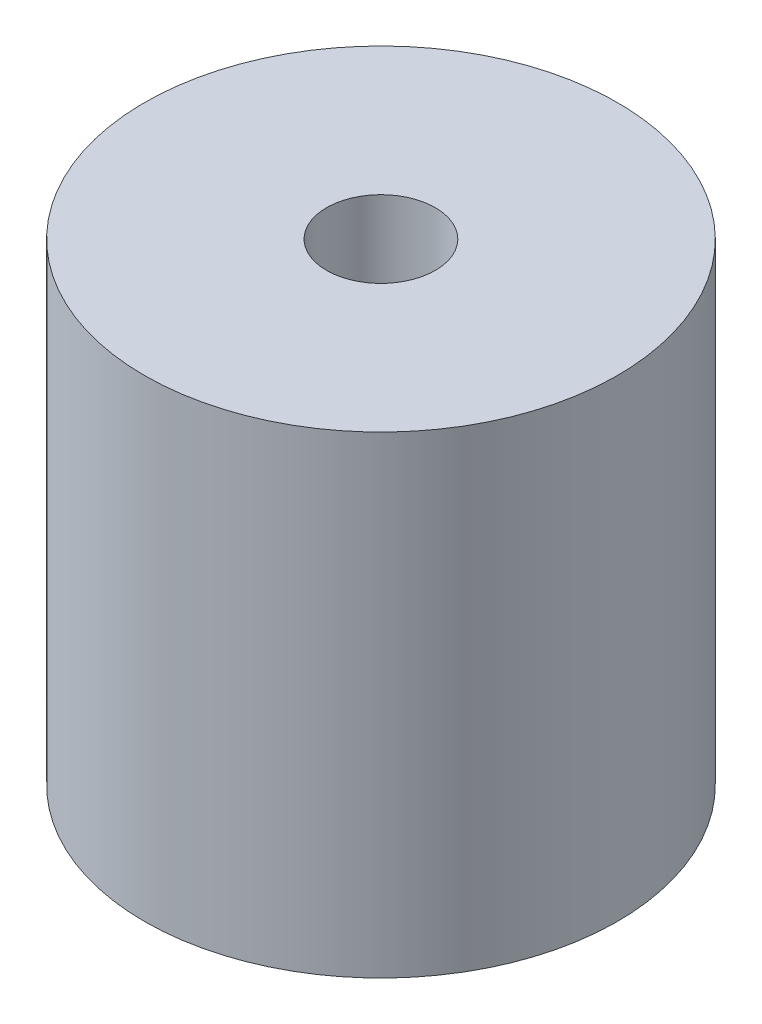
ISO-10303-21;
HEADER;
FILE_DESCRIPTION(('STEP AP214'),'2;1');
FILE_NAME('part.step','',(''),(''),'','','');
FILE_SCHEMA(('AUTOMOTIVE_DESIGN { 1 0 10303 214 1 1 1 1 }'));
ENDSEC;
DATA;
#1=APPLICATION_CONTEXT('core data for automotive mechanical design processes');
#2=APPLICATION_PROTOCOL_DEFINITION('international standard','automotive_design',2000,#1);
#3=PRODUCT_CONTEXT('',#1,'mechanical');
#4=PRODUCT('Part','Part','',(#3));
#5=PRODUCT_RELATED_PRODUCT_CATEGORY('part','',(#4));
#6=PRODUCT_DEFINITION_FORMATION('','',#4);
#7=PRODUCT_DEFINITION_CONTEXT('part definition',#1,'design');
#8=PRODUCT_DEFINITION('design','',#6,#7);
#9=PRODUCT_DEFINITION_SHAPE('','',#8);
#10=(LENGTH_UNIT() NAMED_UNIT(*) SI_UNIT(.MILLI.,.METRE.));
#11=(NAMED_UNIT(*) PLANE_ANGLE_UNIT() SI_UNIT($,.RADIAN.));
#12=(NAMED_UNIT(*) SI_UNIT($,.STERADIAN.) SOLID_ANGLE_UNIT());
#13=UNCERTAINTY_MEASURE_WITH_UNIT(LENGTH_MEASURE(1.E-05),#10,'distance_accuracy_value','');
#14=(GEOMETRIC_REPRESENTATION_CONTEXT(3) GLOBAL_UNCERTAINTY_ASSIGNED_CONTEXT((#13)) GLOBAL_UNIT_ASSIGNED_CONTEXT((#10,
#11,#12)) REPRESENTATION_CONTEXT('',''));
#15=CARTESIAN_POINT('',(0.,0.,0.));
#16=DIRECTION('',(0.,0.,1.));
#17=DIRECTION('',(1.,0.,0.));
#18=AXIS2_PLACEMENT_3D('',#15,#16,#17);
#19=CARTESIAN_POINT('',(0.,10.,0.));
#20=DIRECTION('',(0.,-1.,0.));
#21=DIRECTION('',(0.,0.,-1.));
#22=AXIS2_PLACEMENT_3D('',#19,#20,#21);
#23=CYLINDRICAL_SURFACE('',#22,5.);
#24=CARTESIAN_POINT('',(0.,10.,0.));
#25=DIRECTION('',(0.,1.,0.));
#26=DIRECTION('',(0.,0.,1.));
#27=AXIS2_PLACEMENT_3D('',#24,#25,#26);
#28=CIRCLE('',#27,5.);
#29=CARTESIAN_POINT('',(0.,10.,5.));
#30=VERTEX_POINT('',#29);
#31=EDGE_CURVE('E11',#30,#30,#28,.T.);
#32=ORIENTED_EDGE('',*,*,#31,.F.);
#33=EDGE_LOOP('',(#32));
#34=FACE_BOUND('',#33,.T.);
#35=CARTESIAN_POINT('',(0.,0.,0.));
#36=DIRECTION('',(0.,1.,0.));
#37=DIRECTION('',(0.,0.,1.));
#38=AXIS2_PLACEMENT_3D('',#35,#36,#37);
#39=CIRCLE('',#38,5.);
#40=CARTESIAN_POINT('',(0.,0.,5.));
#41=VERTEX_POINT('',#40);
#42=EDGE_CURVE('E40',#41,#41,#39,.T.);
#43=ORIENTED_EDGE('',*,*,#42,.T.);
#44=EDGE_LOOP('',(#43));
#45=FACE_BOUND('',#44,.T.);
#46=ADVANCED_FACE('F37',(#34,#45),#23,.T.);
#47=CARTESIAN_POINT('',(0.,10.,0.));
#48=DIRECTION('',(0.,1.,0.));
#49=DIRECTION('',(0.,0.,1.));
#50=AXIS2_PLACEMENT_3D('',#47,#48,#49);
#51=PLANE('',#50);
#52=CARTESIAN_POINT('',(0.,10.,0.));
#53=DIRECTION('',(0.,1.,0.));
#54=DIRECTION('',(0.,0.,1.));
#55=AXIS2_PLACEMENT_3D('',#52,#53,#54);
#56=CIRCLE('',#55,1.15);
#57=CARTESIAN_POINT('',(0.,10.,1.15));
#58=VERTEX_POINT('',#57);
#59=EDGE_CURVE('E57',#58,#58,#56,.T.);
#60=ORIENTED_EDGE('',*,*,#59,.F.);
#61=EDGE_LOOP('',(#60));
#62=FACE_BOUND('',#61,.T.);
#63=ORIENTED_EDGE('',*,*,#31,.T.);
#64=EDGE_LOOP('',(#63));
#65=FACE_BOUND('',#64,.T.);
#66=ADVANCED_FACE('F79',(#62,#65),#51,.T.);
#67=CARTESIAN_POINT('',(0.,0.,0.));
#68=DIRECTION('',(0.,1.,0.));
#69=DIRECTION('',(0.,0.,1.));
#70=AXIS2_PLACEMENT_3D('',#67,#68,#69);
#71=PLANE('',#70);
#72=CARTESIAN_POINT('',(0.,0.,0.));
#73=DIRECTION('',(0.,-1.,0.));
#74=DIRECTION('',(0.,0.,-1.));
#75=AXIS2_PLACEMENT_3D('',#72,#73,#74);
#76=CIRCLE('',#75,4.50169913121697);
#77=CARTESIAN_POINT('',(0.,0.,-4.50169913121697));
#78=VERTEX_POINT('',#77);
#79=EDGE_CURVE('E66',#78,#78,#76,.T.);
#80=ORIENTED_EDGE('',*,*,#79,.F.);
#81=EDGE_LOOP('',(#80));
#82=FACE_BOUND('',#81,.T.);
#83=ORIENTED_EDGE('',*,*,#42,.F.);
#84=EDGE_LOOP('',(#83));
#85=FACE_BOUND('',#84,.T.);
#86=ADVANCED_FACE('F76',(#82,#85),#71,.F.);
#87=CARTESIAN_POINT('',(0.,0.5,0.));
#88=DIRECTION('',(0.,-1.,0.));
#89=DIRECTION('',(0.,0.,-1.));
#90=AXIS2_PLACEMENT_3D('',#87,#88,#89);
#91=CYLINDRICAL_SURFACE('',#90,4.50169913121697);
#92=CARTESIAN_POINT('',(0.,0.5,0.));
#93=DIRECTION('',(0.,-1.,0.));
#94=DIRECTION('',(0.,0.,-1.));
#95=AXIS2_PLACEMENT_3D('',#92,#93,#94);
#96=CIRCLE('',#95,4.50169913121697);
#97=CARTESIAN_POINT('',(0.,0.5,-4.50169913121697));
#98=VERTEX_POINT('',#97);
#99=EDGE_CURVE('E68',#98,#98,#96,.T.);
#100=ORIENTED_EDGE('',*,*,#99,.F.);
#101=EDGE_LOOP('',(#100));
#102=FACE_BOUND('',#101,.T.);
#103=ORIENTED_EDGE('',*,*,#79,.T.);
#104=EDGE_LOOP('',(#103));
#105=FACE_BOUND('',#104,.T.);
#106=ADVANCED_FACE('F74',(#102,#105),#91,.F.);
#107=CARTESIAN_POINT('',(0.,0.5,0.));
#108=DIRECTION('',(0.,-1.,0.));
#109=DIRECTION('',(0.,0.,-1.));
#110=AXIS2_PLACEMENT_3D('',#107,#108,#109);
#111=PLANE('',#110);
#112=CARTESIAN_POINT('',(0.,0.5,0.));
#113=DIRECTION('',(0.,-1.,0.));
#114=DIRECTION('',(0.,0.,-1.));
#115=AXIS2_PLACEMENT_3D('',#112,#113,#114);
#116=CIRCLE('',#115,2.);
#117=CARTESIAN_POINT('',(0.,0.5,-2.));
#118=VERTEX_POINT('',#117);
#119=EDGE_CURVE('E60',#118,#118,#116,.T.);
#120=ORIENTED_EDGE('',*,*,#119,.F.);
#121=EDGE_LOOP('',(#120));
#122=FACE_BOUND('',#121,.T.);
#123=ORIENTED_EDGE('',*,*,#99,.T.);
#124=EDGE_LOOP('',(#123));
#125=FACE_BOUND('',#124,.T.);
#126=ADVANCED_FACE('F98',(#122,#125),#111,.T.);
#127=CARTESIAN_POINT('',(0.,0.5,0.));
#128=DIRECTION('',(0.,-1.,0.));
#129=DIRECTION('',(0.,0.,-1.));
#130=AXIS2_PLACEMENT_3D('',#127,#128,#129);
#131=CYLINDRICAL_SURFACE('',#130,2.);
#132=ORIENTED_EDGE('',*,*,#119,.T.);
#133=EDGE_LOOP('',(#132));
#134=FACE_BOUND('',#133,.T.);
#135=CARTESIAN_POINT('',(0.,0.,0.));
#136=DIRECTION('',(0.,-1.,0.));
#137=DIRECTION('',(0.,0.,-1.));
#138=AXIS2_PLACEMENT_3D('',#135,#136,#137);
#139=CIRCLE('',#138,2.);
#140=CARTESIAN_POINT('',(0.,0.,-2.));
#141=VERTEX_POINT('',#140);
#142=EDGE_CURVE('E56',#141,#141,#139,.T.);
#143=ORIENTED_EDGE('',*,*,#142,.F.);
#144=EDGE_LOOP('',(#143));
#145=FACE_BOUND('',#144,.T.);
#146=ADVANCED_FACE('F102',(#134,#145),#131,.T.);
#147=ORIENTED_EDGE('',*,*,#142,.T.);
#148=EDGE_LOOP('',(#147));
#149=FACE_BOUND('',#148,.T.);
#150=ADVANCED_FACE('F50',(#149),#71,.F.);
#151=CARTESIAN_POINT('',(0.,8.,0.));
#152=DIRECTION('',(0.,1.,0.));
#153=DIRECTION('',(0.,0.,1.));
#154=AXIS2_PLACEMENT_3D('',#151,#152,#153);
#155=CONICAL_SURFACE('',#154,1.15,1.02974425867665);
#156=CARTESIAN_POINT('',(0.,7.30901028811831,0.));
#157=VERTEX_POINT('',#156);
#158=VERTEX_LOOP('',#157);
#159=FACE_BOUND('',#158,.T.);
#160=CARTESIAN_POINT('',(0.,8.,0.));
#161=DIRECTION('',(0.,1.,0.));
#162=DIRECTION('',(0.,0.,1.));
#163=AXIS2_PLACEMENT_3D('',#160,#161,#162);
#164=CIRCLE('',#163,1.15);
#165=CARTESIAN_POINT('',(0.,8.,1.15));
#166=VERTEX_POINT('',#165);
#167=EDGE_CURVE('E54',#166,#166,#164,.T.);
#168=ORIENTED_EDGE('',*,*,#167,.T.);
#169=EDGE_LOOP('',(#168));
#170=FACE_BOUND('',#169,.T.);
#171=ADVANCED_FACE('F46',(#159,#170),#155,.F.);
#172=CARTESIAN_POINT('',(0.,10.,0.));
#173=DIRECTION('',(0.,1.,0.));
#174=DIRECTION('',(0.,0.,1.));
#175=AXIS2_PLACEMENT_3D('',#172,#173,#174);
#176=CYLINDRICAL_SURFACE('',#175,1.15);
#177=ORIENTED_EDGE('',*,*,#167,.F.);
#178=EDGE_LOOP('',(#177));
#179=FACE_BOUND('',#178,.T.);
#180=ORIENTED_EDGE('',*,*,#59,.T.);
#181=EDGE_LOOP('',(#180));
#182=FACE_BOUND('',#181,.T.);
#183=ADVANCED_FACE('F49',(#179,#182),#176,.F.);
#184=CLOSED_SHELL('',(#46,#66,#86,#106,#126,#146,#150,#171,#183));
#185=MANIFOLD_SOLID_BREP('B2',#184);
#186=ADVANCED_BREP_SHAPE_REPRESENTATION('',(#18,#185),#14);
#187=SHAPE_DEFINITION_REPRESENTATION(#9,#186);
ENDSEC;
END-ISO-10303-21;
